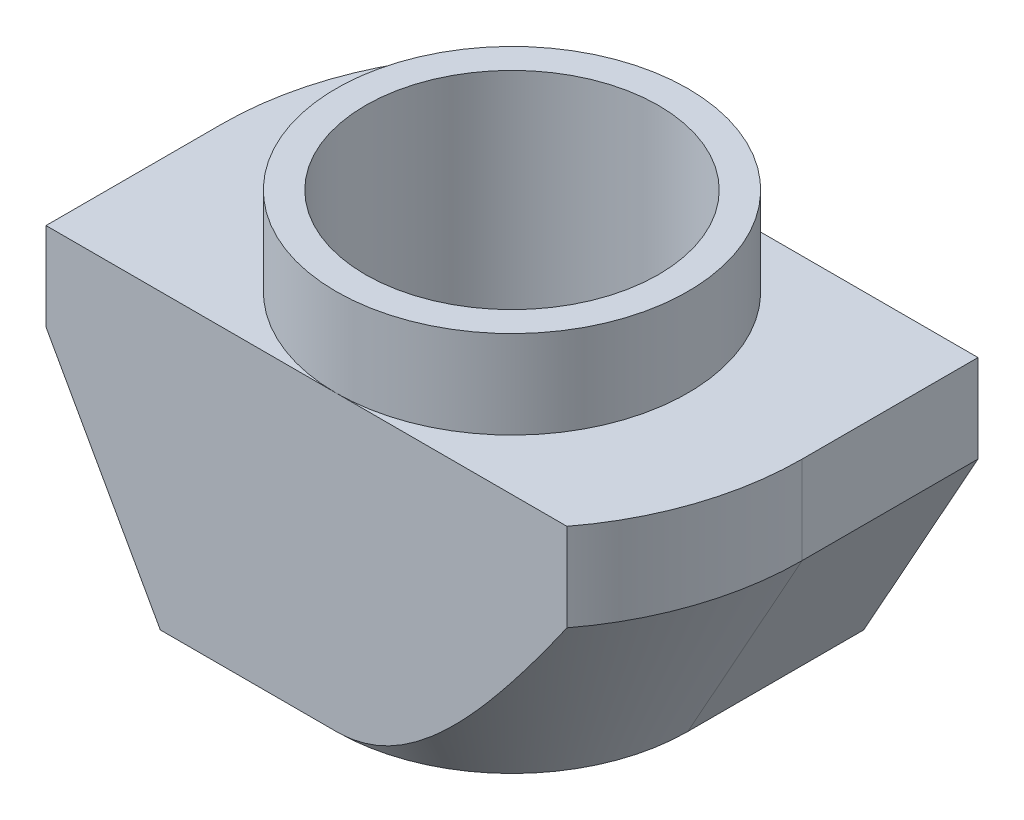
ISO-10303-21;
HEADER;
FILE_DESCRIPTION(('STEP AP214'),'2;1');
FILE_NAME('part.step','',(''),(''),'','','');
FILE_SCHEMA(('AUTOMOTIVE_DESIGN { 1 0 10303 214 1 1 1 1 }'));
ENDSEC;
DATA;
#1=APPLICATION_CONTEXT('core data for automotive mechanical design processes');
#2=APPLICATION_PROTOCOL_DEFINITION('international standard','automotive_design',2000,#1);
#3=PRODUCT_CONTEXT('',#1,'mechanical');
#4=PRODUCT('Part','Part','',(#3));
#5=PRODUCT_RELATED_PRODUCT_CATEGORY('part','',(#4));
#6=PRODUCT_DEFINITION_FORMATION('','',#4);
#7=PRODUCT_DEFINITION_CONTEXT('part definition',#1,'design');
#8=PRODUCT_DEFINITION('design','',#6,#7);
#9=PRODUCT_DEFINITION_SHAPE('','',#8);
#10=(LENGTH_UNIT() NAMED_UNIT(*) SI_UNIT(.MILLI.,.METRE.));
#11=(NAMED_UNIT(*) PLANE_ANGLE_UNIT() SI_UNIT($,.RADIAN.));
#12=(NAMED_UNIT(*) SI_UNIT($,.STERADIAN.) SOLID_ANGLE_UNIT());
#13=UNCERTAINTY_MEASURE_WITH_UNIT(LENGTH_MEASURE(1.E-05),#10,'distance_accuracy_value','');
#14=(GEOMETRIC_REPRESENTATION_CONTEXT(3) GLOBAL_UNCERTAINTY_ASSIGNED_CONTEXT((#13)) GLOBAL_UNIT_ASSIGNED_CONTEXT((#10,
#11,#12)) REPRESENTATION_CONTEXT('',''));
#15=CARTESIAN_POINT('',(0.,0.,0.));
#16=DIRECTION('',(0.,0.,1.));
#17=DIRECTION('',(1.,0.,0.));
#18=AXIS2_PLACEMENT_3D('',#15,#16,#17);
#19=CARTESIAN_POINT('',(-4.95,-1.5,3.));
#20=DIRECTION('',(1.,0.,0.));
#21=DIRECTION('',(0.,1.,0.));
#22=AXIS2_PLACEMENT_3D('',#19,#20,#21);
#23=PLANE('',#22);
#24=DIRECTION('',(0.,0.,-1.));
#25=VECTOR('',#24,1.);
#26=CARTESIAN_POINT('',(-4.95,-3.,3.));
#27=LINE('',#26,#25);
#28=CARTESIAN_POINT('',(-4.95,-3.,3.));
#29=VERTEX_POINT('',#28);
#30=CARTESIAN_POINT('',(-4.95,-3.,0.));
#31=VERTEX_POINT('',#30);
#32=EDGE_CURVE('E197',#29,#31,#27,.T.);
#33=ORIENTED_EDGE('',*,*,#32,.F.);
#34=DIRECTION('',(0.,-1.,0.));
#35=VECTOR('',#34,1.);
#36=CARTESIAN_POINT('',(-4.95,-1.5,3.));
#37=LINE('',#36,#35);
#38=CARTESIAN_POINT('',(-4.95,-1.5,3.));
#39=VERTEX_POINT('',#38);
#40=EDGE_CURVE('E132',#39,#29,#37,.T.);
#41=ORIENTED_EDGE('',*,*,#40,.F.);
#42=DIRECTION('',(0.,0.,-1.));
#43=VECTOR('',#42,1.);
#44=CARTESIAN_POINT('',(-4.95,-1.5,3.));
#45=LINE('',#44,#43);
#46=CARTESIAN_POINT('',(-4.95,-1.5,0.));
#47=VERTEX_POINT('',#46);
#48=EDGE_CURVE('E12',#39,#47,#45,.T.);
#49=ORIENTED_EDGE('',*,*,#48,.T.);
#50=DIRECTION('',(0.,1.,0.));
#51=VECTOR('',#50,1.);
#52=CARTESIAN_POINT('',(-4.95,-6.5,0.));
#53=LINE('',#52,#51);
#54=EDGE_CURVE('E198',#31,#47,#53,.T.);
#55=ORIENTED_EDGE('',*,*,#54,.F.);
#56=EDGE_LOOP('',(#33,#41,#49,#55));
#57=FACE_BOUND('',#56,.T.);
#58=ADVANCED_FACE('F36',(#57),#23,.F.);
#59=CARTESIAN_POINT('',(-4.95,-6.5,3.));
#60=DIRECTION('',(0.,1.,0.));
#61=DIRECTION('',(0.,0.,1.));
#62=AXIS2_PLACEMENT_3D('',#59,#60,#61);
#63=PLANE('',#62);
#64=CARTESIAN_POINT('',(0.,-6.5,0.));
#65=DIRECTION('',(0.,1.,0.));
#66=DIRECTION('',(0.,0.,1.));
#67=AXIS2_PLACEMENT_3D('',#64,#65,#66);
#68=CIRCLE('',#67,2.49999999999999);
#69=CARTESIAN_POINT('',(0.,-6.5,2.49999999999999));
#70=VERTEX_POINT('',#69);
#71=EDGE_CURVE('E148',#70,#70,#68,.T.);
#72=ORIENTED_EDGE('',*,*,#71,.T.);
#73=EDGE_LOOP('',(#72));
#74=FACE_BOUND('',#73,.T.);
#75=DIRECTION('',(1.,0.,0.));
#76=VECTOR('',#75,1.);
#77=CARTESIAN_POINT('',(-4.95,-6.5,3.));
#78=LINE('',#77,#76);
#79=CARTESIAN_POINT('',(-3.,-6.5,3.));
#80=VERTEX_POINT('',#79);
#81=CARTESIAN_POINT('',(0.,-6.5,3.));
#82=VERTEX_POINT('',#81);
#83=EDGE_CURVE('E130',#80,#82,#78,.T.);
#84=ORIENTED_EDGE('',*,*,#83,.F.);
#85=DIRECTION('',(0.,0.,-1.));
#86=VECTOR('',#85,1.);
#87=CARTESIAN_POINT('',(-3.,-6.5,3.));
#88=LINE('',#87,#86);
#89=CARTESIAN_POINT('',(-3.,-6.5,0.));
#90=VERTEX_POINT('',#89);
#91=EDGE_CURVE('E115',#80,#90,#88,.T.);
#92=ORIENTED_EDGE('',*,*,#91,.T.);
#93=CARTESIAN_POINT('',(0.,-6.5,0.));
#94=DIRECTION('',(0.,-1.,0.));
#95=DIRECTION('',(-1.,0.,0.));
#96=AXIS2_PLACEMENT_3D('',#93,#94,#95);
#97=CIRCLE('',#96,3.);
#98=CARTESIAN_POINT('',(0.,-6.5,-3.));
#99=VERTEX_POINT('',#98);
#100=EDGE_CURVE('E199',#90,#99,#97,.T.);
#101=ORIENTED_EDGE('',*,*,#100,.T.);
#102=DIRECTION('',(1.,0.,0.));
#103=VECTOR('',#102,1.);
#104=CARTESIAN_POINT('',(-4.95,-6.5,-3.));
#105=LINE('',#104,#103);
#106=CARTESIAN_POINT('',(3.,-6.5,-3.));
#107=VERTEX_POINT('',#106);
#108=EDGE_CURVE('E147',#99,#107,#105,.T.);
#109=ORIENTED_EDGE('',*,*,#108,.T.);
#110=DIRECTION('',(0.,0.,1.));
#111=VECTOR('',#110,1.);
#112=CARTESIAN_POINT('',(3.,-6.5,-4.95));
#113=LINE('',#112,#111);
#114=CARTESIAN_POINT('',(3.,-6.5,0.));
#115=VERTEX_POINT('',#114);
#116=EDGE_CURVE('E51',#107,#115,#113,.T.);
#117=ORIENTED_EDGE('',*,*,#116,.T.);
#118=CARTESIAN_POINT('',(0.,-6.5,0.));
#119=DIRECTION('',(0.,-1.,0.));
#120=DIRECTION('',(1.,0.,0.));
#121=AXIS2_PLACEMENT_3D('',#118,#119,#120);
#122=CIRCLE('',#121,3.);
#123=EDGE_CURVE('E136',#115,#82,#122,.T.);
#124=ORIENTED_EDGE('',*,*,#123,.T.);
#125=EDGE_LOOP('',(#84,#92,#101,#109,#117,#124));
#126=FACE_BOUND('',#125,.T.);
#127=ADVANCED_FACE('F135',(#74,#126),#63,.F.);
#128=CARTESIAN_POINT('',(4.95,-1.5,3.));
#129=DIRECTION('',(-1.,0.,0.));
#130=DIRECTION('',(0.,-1.,0.));
#131=AXIS2_PLACEMENT_3D('',#128,#129,#130);
#132=PLANE('',#131);
#133=DIRECTION('',(0.,0.,1.));
#134=VECTOR('',#133,1.);
#135=CARTESIAN_POINT('',(4.95,-3.,-4.95));
#136=LINE('',#135,#134);
#137=CARTESIAN_POINT('',(4.95,-3.,-3.));
#138=VERTEX_POINT('',#137);
#139=CARTESIAN_POINT('',(4.95,-3.,0.));
#140=VERTEX_POINT('',#139);
#141=EDGE_CURVE('E388',#138,#140,#136,.T.);
#142=ORIENTED_EDGE('',*,*,#141,.F.);
#143=DIRECTION('',(0.,1.,0.));
#144=VECTOR('',#143,1.);
#145=CARTESIAN_POINT('',(4.95,-1.5,-3.));
#146=LINE('',#145,#144);
#147=CARTESIAN_POINT('',(4.95,-1.5,-3.));
#148=VERTEX_POINT('',#147);
#149=EDGE_CURVE('E151',#138,#148,#146,.T.);
#150=ORIENTED_EDGE('',*,*,#149,.T.);
#151=DIRECTION('',(0.,0.,-1.));
#152=VECTOR('',#151,1.);
#153=CARTESIAN_POINT('',(4.95,-1.5,3.));
#154=LINE('',#153,#152);
#155=CARTESIAN_POINT('',(4.95,-1.5,0.));
#156=VERTEX_POINT('',#155);
#157=EDGE_CURVE('E44',#156,#148,#154,.T.);
#158=ORIENTED_EDGE('',*,*,#157,.F.);
#159=DIRECTION('',(0.,1.,0.));
#160=VECTOR('',#159,1.);
#161=CARTESIAN_POINT('',(4.95,-6.5,0.));
#162=LINE('',#161,#160);
#163=EDGE_CURVE('E384',#140,#156,#162,.T.);
#164=ORIENTED_EDGE('',*,*,#163,.F.);
#165=EDGE_LOOP('',(#142,#150,#158,#164));
#166=FACE_BOUND('',#165,.T.);
#167=ADVANCED_FACE('F263',(#166),#132,.F.);
#168=CARTESIAN_POINT('',(0.,0.,3.));
#169=DIRECTION('',(0.,0.,-1.));
#170=DIRECTION('',(-1.,0.,0.));
#171=AXIS2_PLACEMENT_3D('',#168,#169,#170);
#172=PLANE('',#171);
#173=DIRECTION('',(-0.486702158215268,0.873567976283815,0.));
#174=VECTOR('',#173,1.);
#175=CARTESIAN_POINT('',(-3.,-6.5,3.));
#176=LINE('',#175,#174);
#177=EDGE_CURVE('E118',#80,#29,#176,.T.);
#178=ORIENTED_EDGE('',*,*,#177,.F.);
#179=ORIENTED_EDGE('',*,*,#83,.T.);
#180=CARTESIAN_POINT('',(7.29218736422203,2.26826416058123,3.));
#181=CARTESIAN_POINT('',(7.15202643726099,2.03562955970684,3.));
#182=CARTESIAN_POINT('',(7.01145063305956,1.80324372339083,3.));
#183=CARTESIAN_POINT('',(6.72927605431873,1.3390870553258,3.));
#184=CARTESIAN_POINT('',(6.58767725705223,1.10731623739757,3.));
#185=CARTESIAN_POINT('',(6.30307250729957,0.644196571221256,3.));
#186=CARTESIAN_POINT('',(6.16006487576055,0.412848753837249,3.));
#187=CARTESIAN_POINT('',(5.8725782551589,-0.0489285339621254,3.));
#188=CARTESIAN_POINT('',(5.72809928029338,-0.279358013208818,3.));
#189=CARTESIAN_POINT('',(5.42998333301444,-0.750696257344528,3.));
#190=CARTESIAN_POINT('',(5.27625264994031,-0.99154584223635,3.));
#191=CARTESIAN_POINT('',(4.9662724467392,-1.47161769692818,3.));
#192=CARTESIAN_POINT('',(4.81002295403066,-1.71083998440184,3.));
#193=CARTESIAN_POINT('',(4.49441064676226,-2.18692387601439,3.));
#194=CARTESIAN_POINT('',(4.33505071247581,-2.42378738348171,3.));
#195=CARTESIAN_POINT('',(4.01203835877085,-2.89455453915112,3.));
#196=CARTESIAN_POINT('',(3.84838621669158,-3.12845837715035,3.));
#197=CARTESIAN_POINT('',(3.51707226528701,-3.58949232522703,3.));
#198=CARTESIAN_POINT('',(3.34947579217336,-3.81666894000739,3.));
#199=CARTESIAN_POINT('',(3.09180830724945,-4.15293869229582,3.));
#200=CARTESIAN_POINT('',(3.00479599679616,-4.26437348955312,3.));
#201=CARTESIAN_POINT('',(2.82826918660686,-4.48523867761659,3.));
#202=CARTESIAN_POINT('',(2.73875485806344,-4.59466920471461,3.));
#203=CARTESIAN_POINT('',(2.55781465063431,-4.80957028110948,3.));
#204=CARTESIAN_POINT('',(2.46642779417979,-4.91507355821246,3.));
#205=CARTESIAN_POINT('',(2.27994113072373,-5.1227406729821,3.));
#206=CARTESIAN_POINT('',(2.18484189586118,-5.22490502080909,3.));
#207=CARTESIAN_POINT('',(1.99020473430481,-5.42443729855251,3.));
#208=CARTESIAN_POINT('',(1.89067865729547,-5.52181671909356,3.));
#209=CARTESIAN_POINT('',(1.68575876963304,-5.71014723442239,3.));
#210=CARTESIAN_POINT('',(1.58036995392208,-5.8011036559539,3.));
#211=CARTESIAN_POINT('',(1.41927044824127,-5.92840727343392,3.));
#212=CARTESIAN_POINT('',(1.36644626989113,-5.96840824163117,3.));
#213=CARTESIAN_POINT('',(1.25888995653748,-6.04579751612215,3.));
#214=CARTESIAN_POINT('',(1.20415744101787,-6.08318529683766,3.));
#215=CARTESIAN_POINT('',(1.09264984190034,-6.15473469414525,3.));
#216=CARTESIAN_POINT('',(1.03587597753228,-6.18889819370232,3.));
#217=CARTESIAN_POINT('',(0.92014677130587,-6.25328006190706,3.));
#218=CARTESIAN_POINT('',(0.861191869300822,-6.28349922050961,3.));
#219=CARTESIAN_POINT('',(0.703132257697893,-6.35669114018602,3.));
#220=CARTESIAN_POINT('',(0.602124397629524,-6.39571060191382,3.));
#221=CARTESIAN_POINT('',(0.394984006224931,-6.45659335462988,3.));
#222=CARTESIAN_POINT('',(0.288859903659101,-6.47848390404385,3.));
#223=CARTESIAN_POINT('',(0.127592749433732,-6.49601455687357,3.));
#224=CARTESIAN_POINT('',(0.0732184315936915,-6.49928500887752,3.));
#225=CARTESIAN_POINT('',(-0.0356001626847598,-6.50050332792811,3.));
#226=CARTESIAN_POINT('',(-0.0900444370329192,-6.49845135047134,3.));
#227=CARTESIAN_POINT('',(-0.198468709958559,-6.48910543840041,3.));
#228=CARTESIAN_POINT('',(-0.252448767602716,-6.48181218097732,3.));
#229=CARTESIAN_POINT('',(-0.359527747369204,-6.46231551826452,3.));
#230=CARTESIAN_POINT('',(-0.412626083115481,-6.45010897171868,3.));
#231=CARTESIAN_POINT('',(-0.591972153915629,-6.4007719642132,3.));
#232=CARTESIAN_POINT('',(-0.715334992836632,-6.35282396351694,3.));
#233=CARTESIAN_POINT('',(-0.893518379079206,-6.26719815304271,3.));
#234=CARTESIAN_POINT('',(-0.951884987274442,-6.23629261434405,3.));
#235=CARTESIAN_POINT('',(-1.06647661656732,-6.17070734778166,3.));
#236=CARTESIAN_POINT('',(-1.12270188011959,-6.13602804892885,3.));
#237=CARTESIAN_POINT('',(-1.25133477481394,-6.05165334569304,3.));
#238=CARTESIAN_POINT('',(-1.32296171652013,-6.00077842714031,3.));
#239=CARTESIAN_POINT('',(-1.46308397442597,-5.89485642438521,3.));
#240=CARTESIAN_POINT('',(-1.531577757682,-5.83980733218275,3.));
#241=CARTESIAN_POINT('',(-1.66594434078125,-5.72638755144028,3.));
#242=CARTESIAN_POINT('',(-1.73181238523961,-5.66801126367299,3.));
#243=CARTESIAN_POINT('',(-1.8611955958535,-5.54869838773435,3.));
#244=CARTESIAN_POINT('',(-1.92471031995822,-5.48776132308526,3.));
#245=CARTESIAN_POINT('',(-2.11352791960345,-5.30062687502334,3.));
#246=CARTESIAN_POINT('',(-2.23572893252681,-5.17130214545234,3.));
#247=CARTESIAN_POINT('',(-2.47387471005142,-4.9073545681798,3.));
#248=CARTESIAN_POINT('',(-2.58982609456613,-4.77273759859633,3.));
#249=CARTESIAN_POINT('',(-2.8250796418439,-4.49006785104137,3.));
#250=CARTESIAN_POINT('',(-2.9440447001872,-4.34173566470912,3.));
#251=CARTESIAN_POINT('',(-3.17793553815728,-4.04191082029282,3.));
#252=CARTESIAN_POINT('',(-3.29286081948468,-3.89041777596957,3.));
#253=CARTESIAN_POINT('',(-3.51965548492199,-3.58493773524111,3.));
#254=CARTESIAN_POINT('',(-3.63152175706121,-3.43094843569306,3.));
#255=CARTESIAN_POINT('',(-3.85272920756488,-3.12116584741586,3.));
#256=CARTESIAN_POINT('',(-3.96207032255546,-2.96537251355786,3.));
#257=CARTESIAN_POINT('',(-4.17326635615867,-2.66022627529869,3.));
#258=CARTESIAN_POINT('',(-4.27522155098747,-2.51094263213963,3.));
#259=CARTESIAN_POINT('',(-4.47759808056646,-2.21133635056199,3.));
#260=CARTESIAN_POINT('',(-4.57801938587072,-2.0610136922778,3.));
#261=CARTESIAN_POINT('',(-4.77736923447432,-1.75982620861958,3.));
#262=CARTESIAN_POINT('',(-4.87630041724206,-1.60896312784132,3.));
#263=CARTESIAN_POINT('',(-5.07306092380898,-1.30653047206145,3.));
#264=CARTESIAN_POINT('',(-5.1708903021285,-1.15496093254677,3.));
#265=CARTESIAN_POINT('',(-5.26826416058119,-1.00310135688604,3.));
#266=B_SPLINE_CURVE_WITH_KNOTS('',3,(#180,#181,#182,#183,#184,#185,#186,#187,#188,#189,#190,
#191,#192,#193,#194,#195,#196,#197,#198,#199,#200,#201,#202,#203,#204,#205,#206,#207,#208,#209,
#210,#211,#212,#213,#214,#215,#216,#217,#218,#219,#220,#221,#222,#223,#224,#225,#226,#227,#228,
#229,#230,#231,#232,#233,#234,#235,#236,#237,#238,#239,#240,#241,#242,#243,#244,#245,#246,#247,
#248,#249,#250,#251,#252,#253,#254,#255,#256,#257,#258,#259,#260,#261,#262,#263,#264,#265),
.UNSPECIFIED.,.F.,.F.,(4,2,2,2,2,2,2,2,2,2,2,2,2,2,2,2,2,2,2,2,2,2,2,2,2,2,2,2,2,2,2,2,2,2,2,2,
2,2,2,2,2,2,4),(0.,0.814786640555679,1.62959143864731,2.44552615567915,3.26145300713641,
4.1186307443895,4.9757991571503,5.83220831717018,6.68856227633371,7.53533629670932,
7.95945482557749,8.38354440618669,8.80221689076438,9.22082510376435,9.63837329584292,
10.0555710366329,10.2542903521768,10.4530495208797,10.651691887454,10.8502944095848,
11.1739701157248,11.4971296807436,11.6603175186181,11.8235005889576,11.9866625792826,
12.1499290515043,12.5443793872301,12.7424404969383,12.9404791140185,13.2038509701598,
13.4673503359477,13.7313070387655,13.995313074756,14.5287806567333,15.0616715862192,
15.6320091897678,16.2024168983425,16.7733847915115,17.3443669987259,17.8866880483789,
18.4290194958655,18.9702384981704,19.5114306007397),.UNSPECIFIED.);
#267=CARTESIAN_POINT('',(3.93732142452201,-3.,3.));
#268=VERTEX_POINT('',#267);
#269=EDGE_CURVE('E208',#268,#82,#266,.T.);
#270=ORIENTED_EDGE('',*,*,#269,.F.);
#271=DIRECTION('',(0.,1.,0.));
#272=VECTOR('',#271,1.);
#273=CARTESIAN_POINT('',(3.93732142452201,-6.5,3.));
#274=LINE('',#273,#272);
#275=CARTESIAN_POINT('',(3.93732142452201,-1.5,3.));
#276=VERTEX_POINT('',#275);
#277=EDGE_CURVE('E383',#268,#276,#274,.T.);
#278=ORIENTED_EDGE('',*,*,#277,.T.);
#279=DIRECTION('',(-1.,0.,0.));
#280=VECTOR('',#279,1.);
#281=CARTESIAN_POINT('',(3.,-1.5,3.));
#282=LINE('',#281,#280);
#283=CARTESIAN_POINT('',(0.,-1.5,3.));
#284=VERTEX_POINT('',#283);
#285=EDGE_CURVE('E137',#276,#284,#282,.T.);
#286=ORIENTED_EDGE('',*,*,#285,.T.);
#287=DIRECTION('',(-1.,0.,0.));
#288=VECTOR('',#287,1.);
#289=CARTESIAN_POINT('',(-3.,-1.5,3.));
#290=LINE('',#289,#288);
#291=EDGE_CURVE('E140',#284,#39,#290,.T.);
#292=ORIENTED_EDGE('',*,*,#291,.T.);
#293=ORIENTED_EDGE('',*,*,#40,.T.);
#294=EDGE_LOOP('',(#178,#179,#270,#278,#286,#292,#293));
#295=FACE_BOUND('',#294,.T.);
#296=ADVANCED_FACE('F128',(#295),#172,.F.);
#297=CARTESIAN_POINT('',(0.,0.,-3.));
#298=DIRECTION('',(0.,0.,-1.));
#299=DIRECTION('',(-1.,0.,0.));
#300=AXIS2_PLACEMENT_3D('',#297,#298,#299);
#301=PLANE('',#300);
#302=ORIENTED_EDGE('',*,*,#108,.F.);
#303=CARTESIAN_POINT('',(5.26826416058119,-1.00310135688605,-3.));
#304=CARTESIAN_POINT('',(5.17770842267666,-1.14433082093824,-3.));
#305=CARTESIAN_POINT('',(5.08675704291128,-1.28530809460823,-3.));
#306=CARTESIAN_POINT('',(4.90391334090107,-1.56665783177356,-3.));
#307=CARTESIAN_POINT('',(4.81202098618123,-1.70703027415576,-3.));
#308=CARTESIAN_POINT('',(4.62704319683139,-1.98722482205037,-3.));
#309=CARTESIAN_POINT('',(4.53395648593774,-2.12704608597658,-3.));
#310=CARTESIAN_POINT('',(4.34650663705608,-2.40582884747355,-3.));
#311=CARTESIAN_POINT('',(4.25214351421602,-2.54479035521908,-3.));
#312=CARTESIAN_POINT('',(4.05940193587047,-2.8253160553328,-3.));
#313=CARTESIAN_POINT('',(3.96098314732628,-2.96685257911801,-3.));
#314=CARTESIAN_POINT('',(3.76222683631534,-3.24857126924169,-3.));
#315=CARTESIAN_POINT('',(3.66188934377969,-3.38875345665605,-3.));
#316=CARTESIAN_POINT('',(3.45892258515411,-3.66734255665087,-3.));
#317=CARTESIAN_POINT('',(3.35629452647723,-3.80575034668415,-3.));
#318=CARTESIAN_POINT('',(3.14814276046967,-4.08036545769983,-3.));
#319=CARTESIAN_POINT('',(3.042619234513,-4.2165729156672,-3.));
#320=CARTESIAN_POINT('',(2.82851929735822,-4.48532462656304,-3.));
#321=CARTESIAN_POINT('',(2.71996349498769,-4.6178852242394,-3.));
#322=CARTESIAN_POINT('',(2.49815282141267,-4.87915322238592,-3.));
#323=CARTESIAN_POINT('',(2.3848957535291,-5.0078587721019,-3.));
#324=CARTESIAN_POINT('',(2.15301066372248,-5.25890155599181,-3.));
#325=CARTESIAN_POINT('',(2.03442049839763,-5.38127346913871,-3.));
#326=CARTESIAN_POINT('',(1.78931926888369,-5.61772690502543,-3.));
#327=CARTESIAN_POINT('',(1.66281642622972,-5.73181677520182,-3.));
#328=CARTESIAN_POINT('',(1.4302835864886,-5.92150204662274,-3.));
#329=CARTESIAN_POINT('',(1.32650317910023,-5.99981385527404,-3.));
#330=CARTESIAN_POINT('',(1.11108968041358,-6.14537225353911,-3.));
#331=CARTESIAN_POINT('',(0.999445439755801,-6.21260266209611,-3.));
#332=CARTESIAN_POINT('',(0.765181933582771,-6.33129987847749,-3.));
#333=CARTESIAN_POINT('',(0.642407634080027,-6.38247745233208,-3.));
#334=CARTESIAN_POINT('',(0.452689794611406,-6.44019058334696,-3.));
#335=CARTESIAN_POINT('',(0.388621590580509,-6.45624318964884,-3.));
#336=CARTESIAN_POINT('',(0.259091959475528,-6.48118793446322,-3.));
#337=CARTESIAN_POINT('',(0.193631036866232,-6.49008262184477,-3.));
#338=CARTESIAN_POINT('',(0.0707300196814521,-6.49948012507423,-3.));
#339=CARTESIAN_POINT('',(0.0133611373986365,-6.50092868093494,-3.));
#340=CARTESIAN_POINT('',(-0.101217058508213,-6.49791688011482,-3.));
#341=CARTESIAN_POINT('',(-0.158426384556563,-6.49345699715873,-3.));
#342=CARTESIAN_POINT('',(-0.272160088036223,-6.47884714328322,-3.));
#343=CARTESIAN_POINT('',(-0.328683781157632,-6.46869190004173,-3.));
#344=CARTESIAN_POINT('',(-0.440556089049325,-6.44316221680924,-3.));
#345=CARTESIAN_POINT('',(-0.495903820339307,-6.42778399062821,-3.));
#346=CARTESIAN_POINT('',(-0.684766927403431,-6.36659123291341,-3.));
#347=CARTESIAN_POINT('',(-0.814577113424215,-6.30909406012431,-3.));
#348=CARTESIAN_POINT('',(-1.00148610446453,-6.20890445171883,-3.));
#349=CARTESIAN_POINT('',(-1.06260693459031,-6.17309488088303,-3.));
#350=CARTESIAN_POINT('',(-1.1824818893863,-6.09768455307717,-3.));
#351=CARTESIAN_POINT('',(-1.24123639880532,-6.05808441599374,-3.));
#352=CARTESIAN_POINT('',(-1.38322940019372,-5.9568311735784,-3.));
#353=CARTESIAN_POINT('',(-1.46522441586801,-5.89344897556831,-3.));
#354=CARTESIAN_POINT('',(-1.62529681576999,-5.76188349199647,-3.));
#355=CARTESIAN_POINT('',(-1.70337197209815,-5.69369752789675,-3.));
#356=CARTESIAN_POINT('',(-1.85635650495618,-5.55359542776792,-3.));
#357=CARTESIAN_POINT('',(-1.93125948218474,-5.48167234796869,-3.));
#358=CARTESIAN_POINT('',(-2.07829222999617,-5.33503615248439,-3.));
#359=CARTESIAN_POINT('',(-2.15042147237294,-5.26032251067657,-3.));
#360=CARTESIAN_POINT('',(-2.36495074297376,-5.03121388213734,-3.));
#361=CARTESIAN_POINT('',(-2.50377693588755,-4.87347168473288,-3.));
#362=CARTESIAN_POINT('',(-2.70681081669979,-4.63273428352104,-3.));
#363=CARTESIAN_POINT('',(-2.77358178486923,-4.55185208379063,-3.));
#364=CARTESIAN_POINT('',(-2.90565667838677,-4.3888968279252,-3.));
#365=CARTESIAN_POINT('',(-2.97096063674272,-4.30682379865246,-3.));
#366=CARTESIAN_POINT('',(-3.13919482347145,-4.09205221603655,-3.));
#367=CARTESIAN_POINT('',(-3.24114082909401,-3.95858404775206,-3.));
#368=CARTESIAN_POINT('',(-3.44244609950464,-3.68970673827622,-3.));
#369=CARTESIAN_POINT('',(-3.54180521224432,-3.55429748371676,-3.));
#370=CARTESIAN_POINT('',(-3.83678246502478,-3.1457553415188,-3.));
#371=CARTESIAN_POINT('',(-4.02926202450085,-2.87035808156589,-3.));
#372=CARTESIAN_POINT('',(-4.40875038791794,-2.31522623636694,-3.));
#373=CARTESIAN_POINT('',(-4.5957502449861,-2.0354855871704,-3.));
#374=CARTESIAN_POINT('',(-4.96553947361763,-1.47328665619275,-3.));
#375=CARTESIAN_POINT('',(-5.14832932606613,-1.19082869007316,-3.));
#376=CARTESIAN_POINT('',(-5.49737412371733,-0.644881094121442,-3.));
#377=CARTESIAN_POINT('',(-5.66385210961812,-0.38153364649588,-3.));
#378=CARTESIAN_POINT('',(-5.99470785045545,0.146489121830762,-3.));
#379=CARTESIAN_POINT('',(-6.15908552963509,0.411164489952349,-3.));
#380=CARTESIAN_POINT('',(-6.48569222606203,0.940783535343496,-3.));
#381=CARTESIAN_POINT('',(-6.64792607163562,1.20572423919326,-3.));
#382=CARTESIAN_POINT('',(-6.97101437623627,1.73642442653425,-3.));
#383=CARTESIAN_POINT('',(-7.13186891564805,2.00218386106662,-3.));
#384=CARTESIAN_POINT('',(-7.292187364222,2.26826416058119,-3.));
#385=B_SPLINE_CURVE_WITH_KNOTS('',3,(#303,#304,#305,#306,#307,#308,#309,#310,#311,#312,#313,
#314,#315,#316,#317,#318,#319,#320,#321,#322,#323,#324,#325,#326,#327,#328,#329,#330,#331,#332,
#333,#334,#335,#336,#337,#338,#339,#340,#341,#342,#343,#344,#345,#346,#347,#348,#349,#350,#351,
#352,#353,#354,#355,#356,#357,#358,#359,#360,#361,#362,#363,#364,#365,#366,#367,#368,#369,#370,
#371,#372,#373,#374,#375,#376,#377,#378,#379,#380,#381,#382,#383,#384),.UNSPECIFIED.,.F.,.F.,(4,
2,2,2,2,2,2,2,2,2,2,2,2,2,2,2,2,2,2,2,2,2,2,2,2,2,2,2,2,2,2,2,2,2,2,2,2,2,2,2,4),(0.,
0.503305226325452,1.00662788170263,1.51054259217558,2.01445132762413,2.53161295951966,
3.04876653044792,3.56565365119565,4.08250846737311,4.59644409468562,5.11062262420763,
5.62159784277377,6.13205068749595,6.5215764304842,6.91166601436244,7.30842650921261,
7.5062325471649,7.70396811700166,7.87583142250643,8.04768094924893,8.21968982414787,
8.39182365700216,8.81496460246321,9.02742027498094,9.23984126292841,9.55050241558898,
9.86133818252032,10.1727737301681,10.4842682941454,11.1143230693317,11.4289641107288,
11.7435980655719,12.2474021057537,12.7512356912026,13.7590920893869,14.7685114572478,
15.7778149471819,16.7124698096874,17.6471582900445,18.579152071234,19.5110911623844),.UNSPECIFIED.);
#386=CARTESIAN_POINT('',(-3.937321424522,-3.00000000000001,-3.));
#387=VERTEX_POINT('',#386);
#388=EDGE_CURVE('E216',#99,#387,#385,.T.);
#389=ORIENTED_EDGE('',*,*,#388,.T.);
#390=DIRECTION('',(0.,1.,0.));
#391=VECTOR('',#390,1.);
#392=CARTESIAN_POINT('',(-3.937321424522,-6.5,-3.));
#393=LINE('',#392,#391);
#394=CARTESIAN_POINT('',(-3.93732142452201,-1.5,-3.));
#395=VERTEX_POINT('',#394);
#396=EDGE_CURVE('E174',#387,#395,#393,.T.);
#397=ORIENTED_EDGE('',*,*,#396,.T.);
#398=DIRECTION('',(-1.,0.,0.));
#399=VECTOR('',#398,1.);
#400=CARTESIAN_POINT('',(-3.,-1.5,-3.));
#401=LINE('',#400,#399);
#402=CARTESIAN_POINT('',(0.,-1.5,-3.));
#403=VERTEX_POINT('',#402);
#404=EDGE_CURVE('E144',#403,#395,#401,.T.);
#405=ORIENTED_EDGE('',*,*,#404,.F.);
#406=DIRECTION('',(-1.,0.,0.));
#407=VECTOR('',#406,1.);
#408=CARTESIAN_POINT('',(3.,-1.5,-3.));
#409=LINE('',#408,#407);
#410=EDGE_CURVE('E153',#148,#403,#409,.T.);
#411=ORIENTED_EDGE('',*,*,#410,.F.);
#412=ORIENTED_EDGE('',*,*,#149,.F.);
#413=DIRECTION('',(-0.486702158215268,-0.873567976283815,0.));
#414=VECTOR('',#413,1.);
#415=CARTESIAN_POINT('',(5.0529512536988,-2.81521569848933,-3.));
#416=LINE('',#415,#414);
#417=EDGE_CURVE('E206',#138,#107,#416,.T.);
#418=ORIENTED_EDGE('',*,*,#417,.T.);
#419=EDGE_LOOP('',(#302,#389,#397,#405,#411,#412,#418));
#420=FACE_BOUND('',#419,.T.);
#421=ADVANCED_FACE('F171',(#420),#301,.T.);
#422=CARTESIAN_POINT('',(0.,-6.5,0.));
#423=DIRECTION('',(0.,1.,0.));
#424=DIRECTION('',(-1.,0.,0.));
#425=AXIS2_PLACEMENT_3D('',#422,#423,#424);
#426=CYLINDRICAL_SURFACE('',#425,4.95);
#427=CARTESIAN_POINT('',(0.,-3.,0.));
#428=DIRECTION('',(0.,-1.,0.));
#429=DIRECTION('',(-1.,0.,0.));
#430=AXIS2_PLACEMENT_3D('',#427,#428,#429);
#431=CIRCLE('',#430,4.95);
#432=EDGE_CURVE('E59',#31,#387,#431,.T.);
#433=ORIENTED_EDGE('',*,*,#432,.F.);
#434=ORIENTED_EDGE('',*,*,#54,.T.);
#435=CARTESIAN_POINT('',(0.,-1.5,0.));
#436=DIRECTION('',(0.,-1.,0.));
#437=DIRECTION('',(-1.,0.,0.));
#438=AXIS2_PLACEMENT_3D('',#435,#436,#437);
#439=CIRCLE('',#438,4.95);
#440=EDGE_CURVE('E194',#47,#395,#439,.T.);
#441=ORIENTED_EDGE('',*,*,#440,.T.);
#442=ORIENTED_EDGE('',*,*,#396,.F.);
#443=EDGE_LOOP('',(#433,#434,#441,#442));
#444=FACE_BOUND('',#443,.T.);
#445=ADVANCED_FACE('F239',(#444),#426,.T.);
#446=CARTESIAN_POINT('',(0.,-6.5,0.));
#447=DIRECTION('',(0.,1.,0.));
#448=DIRECTION('',(-1.,0.,0.));
#449=AXIS2_PLACEMENT_3D('',#446,#447,#448);
#450=CYLINDRICAL_SURFACE('',#449,4.95);
#451=CARTESIAN_POINT('',(0.,-3.,0.));
#452=DIRECTION('',(0.,-1.,0.));
#453=DIRECTION('',(1.,0.,0.));
#454=AXIS2_PLACEMENT_3D('',#451,#452,#453);
#455=CIRCLE('',#454,4.95);
#456=EDGE_CURVE('E204',#140,#268,#455,.T.);
#457=ORIENTED_EDGE('',*,*,#456,.F.);
#458=ORIENTED_EDGE('',*,*,#163,.T.);
#459=CARTESIAN_POINT('',(0.,-1.5,0.));
#460=DIRECTION('',(0.,-1.,0.));
#461=DIRECTION('',(1.,0.,0.));
#462=AXIS2_PLACEMENT_3D('',#459,#460,#461);
#463=CIRCLE('',#462,4.95);
#464=EDGE_CURVE('E165',#156,#276,#463,.T.);
#465=ORIENTED_EDGE('',*,*,#464,.T.);
#466=ORIENTED_EDGE('',*,*,#277,.F.);
#467=EDGE_LOOP('',(#457,#458,#465,#466));
#468=FACE_BOUND('',#467,.T.);
#469=ADVANCED_FACE('F242',(#468),#450,.T.);
#470=CARTESIAN_POINT('',(3.,0.,3.));
#471=DIRECTION('',(0.,-1.,0.));
#472=DIRECTION('',(0.,0.,-1.));
#473=AXIS2_PLACEMENT_3D('',#470,#471,#472);
#474=PLANE('',#473);
#475=CARTESIAN_POINT('',(0.,0.,0.));
#476=DIRECTION('',(0.,1.,0.));
#477=DIRECTION('',(0.,0.,1.));
#478=AXIS2_PLACEMENT_3D('',#475,#476,#477);
#479=CIRCLE('',#478,2.49999999999999);
#480=CARTESIAN_POINT('',(0.,0.,2.49999999999999));
#481=VERTEX_POINT('',#480);
#482=EDGE_CURVE('E184',#481,#481,#479,.T.);
#483=ORIENTED_EDGE('',*,*,#482,.F.);
#484=EDGE_LOOP('',(#483));
#485=FACE_BOUND('',#484,.T.);
#486=CARTESIAN_POINT('',(0.,0.,0.));
#487=DIRECTION('',(0.,1.,0.));
#488=DIRECTION('',(0.,0.,1.));
#489=AXIS2_PLACEMENT_3D('',#486,#487,#488);
#490=CIRCLE('',#489,3.);
#491=CARTESIAN_POINT('',(0.,0.,3.));
#492=VERTEX_POINT('',#491);
#493=EDGE_CURVE('E188',#492,#492,#490,.T.);
#494=ORIENTED_EDGE('',*,*,#493,.T.);
#495=EDGE_LOOP('',(#494));
#496=FACE_BOUND('',#495,.T.);
#497=ADVANCED_FACE('F246',(#485,#496),#474,.F.);
#498=CARTESIAN_POINT('',(-3.,-1.5,3.));
#499=DIRECTION('',(0.,-1.,0.));
#500=DIRECTION('',(1.,0.,0.));
#501=AXIS2_PLACEMENT_3D('',#498,#499,#500);
#502=PLANE('',#501);
#503=ORIENTED_EDGE('',*,*,#404,.T.);
#504=ORIENTED_EDGE('',*,*,#440,.F.);
#505=ORIENTED_EDGE('',*,*,#48,.F.);
#506=ORIENTED_EDGE('',*,*,#291,.F.);
#507=CARTESIAN_POINT('',(0.,-1.5,0.));
#508=DIRECTION('',(0.,-1.,0.));
#509=DIRECTION('',(1.,0.,0.));
#510=AXIS2_PLACEMENT_3D('',#507,#508,#509);
#511=CIRCLE('',#510,3.);
#512=EDGE_CURVE('E182',#403,#284,#511,.F.);
#513=ORIENTED_EDGE('',*,*,#512,.F.);
#514=EDGE_LOOP('',(#503,#504,#505,#506,#513));
#515=FACE_BOUND('',#514,.T.);
#516=ADVANCED_FACE('F38',(#515),#502,.F.);
#517=CARTESIAN_POINT('',(3.,-1.5,3.));
#518=DIRECTION('',(0.,-1.,0.));
#519=DIRECTION('',(1.,0.,0.));
#520=AXIS2_PLACEMENT_3D('',#517,#518,#519);
#521=PLANE('',#520);
#522=ORIENTED_EDGE('',*,*,#285,.F.);
#523=ORIENTED_EDGE('',*,*,#464,.F.);
#524=ORIENTED_EDGE('',*,*,#157,.T.);
#525=ORIENTED_EDGE('',*,*,#410,.T.);
#526=EDGE_CURVE('E180',#284,#403,#511,.F.);
#527=ORIENTED_EDGE('',*,*,#526,.F.);
#528=EDGE_LOOP('',(#522,#523,#524,#525,#527));
#529=FACE_BOUND('',#528,.T.);
#530=ADVANCED_FACE('F161',(#529),#521,.F.);
#531=CARTESIAN_POINT('',(0.,0.,0.));
#532=DIRECTION('',(0.,1.,0.));
#533=DIRECTION('',(0.,0.,1.));
#534=AXIS2_PLACEMENT_3D('',#531,#532,#533);
#535=CYLINDRICAL_SURFACE('',#534,2.49999999999999);
#536=ORIENTED_EDGE('',*,*,#71,.F.);
#537=EDGE_LOOP('',(#536));
#538=FACE_BOUND('',#537,.T.);
#539=ORIENTED_EDGE('',*,*,#482,.T.);
#540=EDGE_LOOP('',(#539));
#541=FACE_BOUND('',#540,.T.);
#542=ADVANCED_FACE('F249',(#538,#541),#535,.F.);
#543=CARTESIAN_POINT('',(0.,-13.2136672310596,0.));
#544=DIRECTION('',(0.,1.,0.));
#545=DIRECTION('',(0.,0.,1.));
#546=AXIS2_PLACEMENT_3D('',#543,#544,#545);
#547=CYLINDRICAL_SURFACE('',#546,3.);
#548=ORIENTED_EDGE('',*,*,#493,.F.);
#549=EDGE_LOOP('',(#548));
#550=FACE_BOUND('',#549,.T.);
#551=ORIENTED_EDGE('',*,*,#526,.T.);
#552=ORIENTED_EDGE('',*,*,#512,.T.);
#553=EDGE_LOOP('',(#551,#552));
#554=FACE_BOUND('',#553,.T.);
#555=ADVANCED_FACE('F181',(#550,#554),#547,.T.);
#556=CARTESIAN_POINT('',(3.,-6.5,-4.95));
#557=DIRECTION('',(0.873567976283815,-0.486702158215268,0.));
#558=DIRECTION('',(0.486702158215268,0.873567976283815,0.));
#559=AXIS2_PLACEMENT_3D('',#556,#557,#558);
#560=PLANE('',#559);
#561=ORIENTED_EDGE('',*,*,#141,.T.);
#562=DIRECTION('',(0.486702158215268,0.873567976283815,0.));
#563=VECTOR('',#562,1.);
#564=CARTESIAN_POINT('',(3.,-6.5,0.));
#565=LINE('',#564,#563);
#566=EDGE_CURVE('E390',#115,#140,#565,.T.);
#567=ORIENTED_EDGE('',*,*,#566,.F.);
#568=ORIENTED_EDGE('',*,*,#116,.F.);
#569=ORIENTED_EDGE('',*,*,#417,.F.);
#570=EDGE_LOOP('',(#561,#567,#568,#569));
#571=FACE_BOUND('',#570,.T.);
#572=ADVANCED_FACE('F230',(#571),#560,.T.);
#573=CARTESIAN_POINT('',(0.,-6.5,0.));
#574=DIRECTION('',(0.,1.,0.));
#575=DIRECTION('',(0.,0.,1.));
#576=AXIS2_PLACEMENT_3D('',#573,#574,#575);
#577=CONICAL_SURFACE('',#576,3.,0.508310625010827);
#578=ORIENTED_EDGE('',*,*,#269,.T.);
#579=ORIENTED_EDGE('',*,*,#123,.F.);
#580=ORIENTED_EDGE('',*,*,#566,.T.);
#581=ORIENTED_EDGE('',*,*,#456,.T.);
#582=EDGE_LOOP('',(#578,#579,#580,#581));
#583=FACE_BOUND('',#582,.T.);
#584=ADVANCED_FACE('F226',(#583),#577,.T.);
#585=CARTESIAN_POINT('',(-3.,-6.5,3.));
#586=DIRECTION('',(-0.873567976283815,-0.486702158215269,0.));
#587=DIRECTION('',(0.486702158215269,-0.873567976283815,0.));
#588=AXIS2_PLACEMENT_3D('',#585,#586,#587);
#589=PLANE('',#588);
#590=ORIENTED_EDGE('',*,*,#32,.T.);
#591=DIRECTION('',(-0.486702158215268,0.873567976283815,0.));
#592=VECTOR('',#591,1.);
#593=CARTESIAN_POINT('',(-3.,-6.5,0.));
#594=LINE('',#593,#592);
#595=EDGE_CURVE('E120',#90,#31,#594,.T.);
#596=ORIENTED_EDGE('',*,*,#595,.F.);
#597=ORIENTED_EDGE('',*,*,#91,.F.);
#598=ORIENTED_EDGE('',*,*,#177,.T.);
#599=EDGE_LOOP('',(#590,#596,#597,#598));
#600=FACE_BOUND('',#599,.T.);
#601=ADVANCED_FACE('F117',(#600),#589,.T.);
#602=CARTESIAN_POINT('',(0.,-6.5,0.));
#603=DIRECTION('',(0.,1.,0.));
#604=DIRECTION('',(0.,0.,1.));
#605=AXIS2_PLACEMENT_3D('',#602,#603,#604);
#606=CONICAL_SURFACE('',#605,3.,0.508310625010827);
#607=ORIENTED_EDGE('',*,*,#100,.F.);
#608=ORIENTED_EDGE('',*,*,#595,.T.);
#609=ORIENTED_EDGE('',*,*,#432,.T.);
#610=ORIENTED_EDGE('',*,*,#388,.F.);
#611=EDGE_LOOP('',(#607,#608,#609,#610));
#612=FACE_BOUND('',#611,.T.);
#613=ADVANCED_FACE('F232',(#612),#606,.T.);
#614=CLOSED_SHELL('',(#58,#127,#167,#296,#421,#445,#469,#497,#516,#530,#542,#555,#572,#584,#601,#613));
#615=MANIFOLD_SOLID_BREP('B2',#614);
#616=ADVANCED_BREP_SHAPE_REPRESENTATION('',(#18,#615),#14);
#617=SHAPE_DEFINITION_REPRESENTATION(#9,#616);
ENDSEC;
END-ISO-10303-21;
